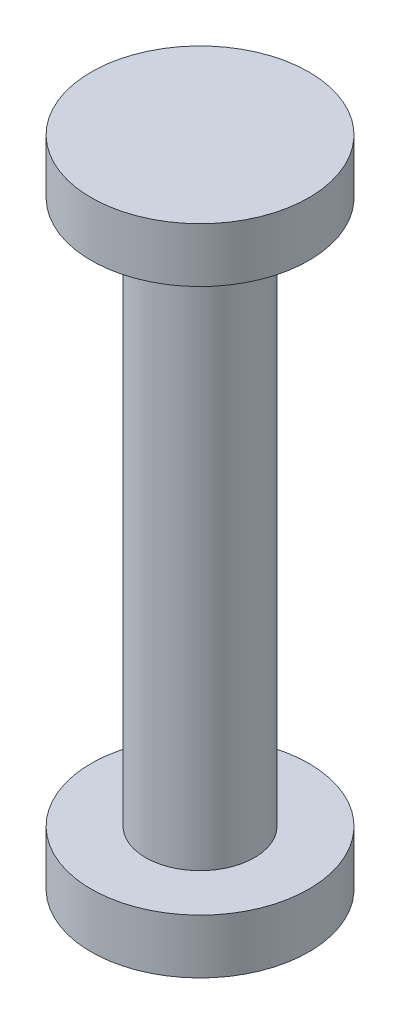
ISO-10303-21;
HEADER;
FILE_DESCRIPTION(('STEP AP214'),'2;1');
FILE_NAME('part.step','',(''),(''),'','','');
FILE_SCHEMA(('AUTOMOTIVE_DESIGN { 1 0 10303 214 1 1 1 1 }'));
ENDSEC;
DATA;
#1=APPLICATION_CONTEXT('core data for automotive mechanical design processes');
#2=APPLICATION_PROTOCOL_DEFINITION('international standard','automotive_design',2000,#1);
#3=PRODUCT_CONTEXT('',#1,'mechanical');
#4=PRODUCT('Part','Part','',(#3));
#5=PRODUCT_RELATED_PRODUCT_CATEGORY('part','',(#4));
#6=PRODUCT_DEFINITION_FORMATION('','',#4);
#7=PRODUCT_DEFINITION_CONTEXT('part definition',#1,'design');
#8=PRODUCT_DEFINITION('design','',#6,#7);
#9=PRODUCT_DEFINITION_SHAPE('','',#8);
#10=(LENGTH_UNIT() NAMED_UNIT(*) SI_UNIT(.MILLI.,.METRE.));
#11=(NAMED_UNIT(*) PLANE_ANGLE_UNIT() SI_UNIT($,.RADIAN.));
#12=(NAMED_UNIT(*) SI_UNIT($,.STERADIAN.) SOLID_ANGLE_UNIT());
#13=UNCERTAINTY_MEASURE_WITH_UNIT(LENGTH_MEASURE(1.E-05),#10,'distance_accuracy_value','');
#14=(GEOMETRIC_REPRESENTATION_CONTEXT(3) GLOBAL_UNCERTAINTY_ASSIGNED_CONTEXT((#13)) GLOBAL_UNIT_ASSIGNED_CONTEXT((#10,
#11,#12)) REPRESENTATION_CONTEXT('',''));
#15=CARTESIAN_POINT('',(0.,0.,0.));
#16=DIRECTION('',(0.,0.,1.));
#17=DIRECTION('',(1.,0.,0.));
#18=AXIS2_PLACEMENT_3D('',#15,#16,#17);
#19=CARTESIAN_POINT('',(0.,25.,0.));
#20=DIRECTION('',(0.,-1.,0.));
#21=DIRECTION('',(0.,0.,-1.));
#22=AXIS2_PLACEMENT_3D('',#19,#20,#21);
#23=CYLINDRICAL_SURFACE('',#22,5.);
#24=CARTESIAN_POINT('',(0.,25.,0.));
#25=DIRECTION('',(0.,1.,0.));
#26=DIRECTION('',(0.,0.,1.));
#27=AXIS2_PLACEMENT_3D('',#24,#25,#26);
#28=CIRCLE('',#27,5.);
#29=CARTESIAN_POINT('',(0.,25.,5.));
#30=VERTEX_POINT('',#29);
#31=EDGE_CURVE('E10',#30,#30,#28,.T.);
#32=ORIENTED_EDGE('',*,*,#31,.F.);
#33=EDGE_LOOP('',(#32));
#34=FACE_BOUND('',#33,.T.);
#35=CARTESIAN_POINT('',(0.,-25.,0.));
#36=DIRECTION('',(0.,1.,0.));
#37=DIRECTION('',(0.,0.,1.));
#38=AXIS2_PLACEMENT_3D('',#35,#36,#37);
#39=CIRCLE('',#38,5.);
#40=CARTESIAN_POINT('',(0.,-25.,5.));
#41=VERTEX_POINT('',#40);
#42=EDGE_CURVE('E40',#41,#41,#39,.T.);
#43=ORIENTED_EDGE('',*,*,#42,.T.);
#44=EDGE_LOOP('',(#43));
#45=FACE_BOUND('',#44,.T.);
#46=ADVANCED_FACE('F37',(#34,#45),#23,.T.);
#47=CARTESIAN_POINT('',(0.,-30.,0.));
#48=DIRECTION('',(0.,1.,0.));
#49=DIRECTION('',(0.,0.,1.));
#50=AXIS2_PLACEMENT_3D('',#47,#48,#49);
#51=CYLINDRICAL_SURFACE('',#50,10.);
#52=CARTESIAN_POINT('',(0.,-30.,0.));
#53=DIRECTION('',(0.,-1.,0.));
#54=DIRECTION('',(0.,0.,-1.));
#55=AXIS2_PLACEMENT_3D('',#52,#53,#54);
#56=CIRCLE('',#55,10.);
#57=CARTESIAN_POINT('',(0.,-30.,-10.));
#58=VERTEX_POINT('',#57);
#59=EDGE_CURVE('E49',#58,#58,#56,.T.);
#60=ORIENTED_EDGE('',*,*,#59,.F.);
#61=EDGE_LOOP('',(#60));
#62=FACE_BOUND('',#61,.T.);
#63=CARTESIAN_POINT('',(0.,-25.,0.));
#64=DIRECTION('',(0.,-1.,0.));
#65=DIRECTION('',(0.,0.,-1.));
#66=AXIS2_PLACEMENT_3D('',#63,#64,#65);
#67=CIRCLE('',#66,10.);
#68=CARTESIAN_POINT('',(0.,-25.,-10.));
#69=VERTEX_POINT('',#68);
#70=EDGE_CURVE('E51',#69,#69,#67,.T.);
#71=ORIENTED_EDGE('',*,*,#70,.T.);
#72=EDGE_LOOP('',(#71));
#73=FACE_BOUND('',#72,.T.);
#74=ADVANCED_FACE('F82',(#62,#73),#51,.T.);
#75=CARTESIAN_POINT('',(0.,-30.,0.));
#76=DIRECTION('',(0.,-1.,0.));
#77=DIRECTION('',(0.,0.,-1.));
#78=AXIS2_PLACEMENT_3D('',#75,#76,#77);
#79=PLANE('',#78);
#80=ORIENTED_EDGE('',*,*,#59,.T.);
#81=EDGE_LOOP('',(#80));
#82=FACE_BOUND('',#81,.T.);
#83=ADVANCED_FACE('F87',(#82),#79,.T.);
#84=CARTESIAN_POINT('',(0.,-25.,0.));
#85=DIRECTION('',(0.,-1.,0.));
#86=DIRECTION('',(0.,0.,-1.));
#87=AXIS2_PLACEMENT_3D('',#84,#85,#86);
#88=PLANE('',#87);
#89=ORIENTED_EDGE('',*,*,#42,.F.);
#90=EDGE_LOOP('',(#89));
#91=FACE_BOUND('',#90,.T.);
#92=ORIENTED_EDGE('',*,*,#70,.F.);
#93=EDGE_LOOP('',(#92));
#94=FACE_BOUND('',#93,.T.);
#95=ADVANCED_FACE('F79',(#91,#94),#88,.F.);
#96=CARTESIAN_POINT('',(0.,30.,0.));
#97=DIRECTION('',(0.,-1.,0.));
#98=DIRECTION('',(0.,0.,-1.));
#99=AXIS2_PLACEMENT_3D('',#96,#97,#98);
#100=CYLINDRICAL_SURFACE('',#99,10.);
#101=CARTESIAN_POINT('',(0.,30.,0.));
#102=DIRECTION('',(0.,-1.,0.));
#103=DIRECTION('',(0.,0.,-1.));
#104=AXIS2_PLACEMENT_3D('',#101,#102,#103);
#105=CIRCLE('',#104,10.);
#106=CARTESIAN_POINT('',(0.,30.,-10.));
#107=VERTEX_POINT('',#106);
#108=EDGE_CURVE('E55',#107,#107,#105,.T.);
#109=ORIENTED_EDGE('',*,*,#108,.T.);
#110=EDGE_LOOP('',(#109));
#111=FACE_BOUND('',#110,.T.);
#112=CARTESIAN_POINT('',(0.,25.,0.));
#113=DIRECTION('',(0.,-1.,0.));
#114=DIRECTION('',(0.,0.,-1.));
#115=AXIS2_PLACEMENT_3D('',#112,#113,#114);
#116=CIRCLE('',#115,10.);
#117=CARTESIAN_POINT('',(0.,25.,-10.));
#118=VERTEX_POINT('',#117);
#119=EDGE_CURVE('E59',#118,#118,#116,.T.);
#120=ORIENTED_EDGE('',*,*,#119,.F.);
#121=EDGE_LOOP('',(#120));
#122=FACE_BOUND('',#121,.T.);
#123=ADVANCED_FACE('F67',(#111,#122),#100,.T.);
#124=CARTESIAN_POINT('',(0.,30.,0.));
#125=DIRECTION('',(0.,1.,0.));
#126=DIRECTION('',(0.,0.,-1.));
#127=AXIS2_PLACEMENT_3D('',#124,#125,#126);
#128=PLANE('',#127);
#129=ORIENTED_EDGE('',*,*,#108,.F.);
#130=EDGE_LOOP('',(#129));
#131=FACE_BOUND('',#130,.T.);
#132=ADVANCED_FACE('F70',(#131),#128,.T.);
#133=CARTESIAN_POINT('',(0.,25.,0.));
#134=DIRECTION('',(0.,1.,0.));
#135=DIRECTION('',(0.,0.,-1.));
#136=AXIS2_PLACEMENT_3D('',#133,#134,#135);
#137=PLANE('',#136);
#138=ORIENTED_EDGE('',*,*,#31,.T.);
#139=EDGE_LOOP('',(#138));
#140=FACE_BOUND('',#139,.T.);
#141=ORIENTED_EDGE('',*,*,#119,.T.);
#142=EDGE_LOOP('',(#141));
#143=FACE_BOUND('',#142,.T.);
#144=ADVANCED_FACE('F72',(#140,#143),#137,.F.);
#145=CLOSED_SHELL('',(#46,#74,#83,#95,#123,#132,#144));
#146=MANIFOLD_SOLID_BREP('B2',#145);
#147=ADVANCED_BREP_SHAPE_REPRESENTATION('',(#18,#146),#14);
#148=SHAPE_DEFINITION_REPRESENTATION(#9,#147);
ENDSEC;
END-ISO-10303-21;
